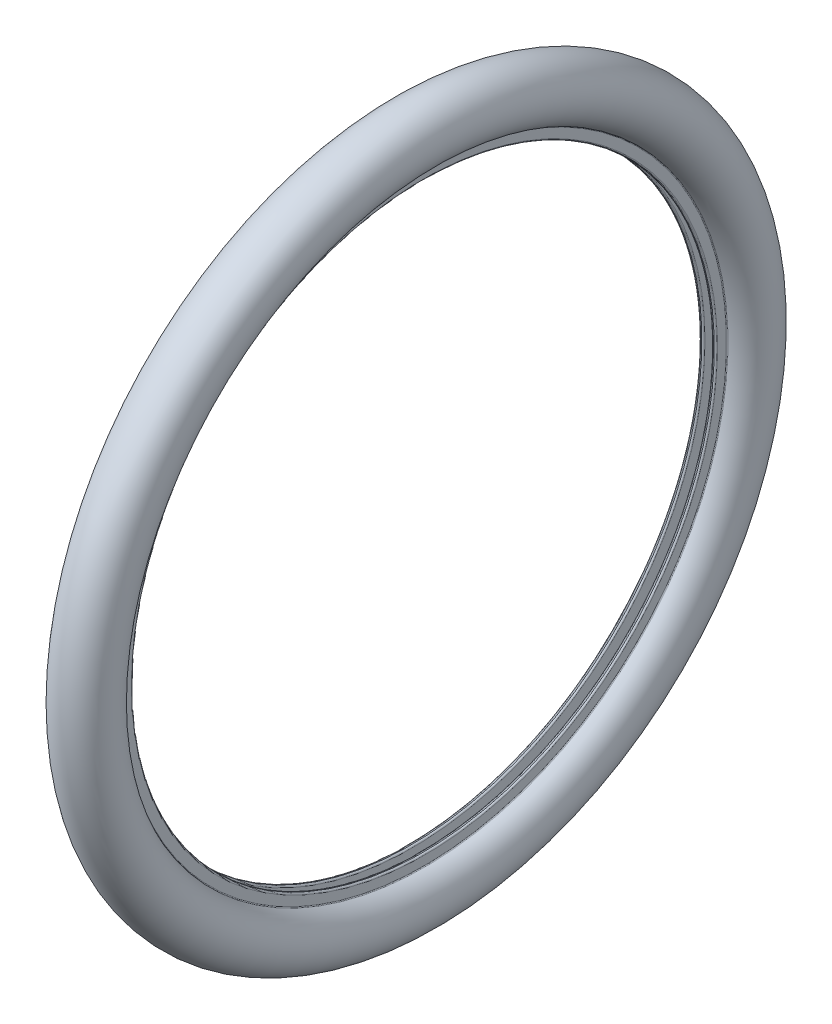
ISO-10303-21;
HEADER;
FILE_DESCRIPTION(('STEP AP214'),'2;1');
FILE_NAME('part.step','',(''),(''),'','','');
FILE_SCHEMA(('AUTOMOTIVE_DESIGN { 1 0 10303 214 1 1 1 1 }'));
ENDSEC;
DATA;
#1=APPLICATION_CONTEXT('core data for automotive mechanical design processes');
#2=APPLICATION_PROTOCOL_DEFINITION('international standard','automotive_design',2000,#1);
#3=PRODUCT_CONTEXT('',#1,'mechanical');
#4=PRODUCT('Part','Part','',(#3));
#5=PRODUCT_RELATED_PRODUCT_CATEGORY('part','',(#4));
#6=PRODUCT_DEFINITION_FORMATION('','',#4);
#7=PRODUCT_DEFINITION_CONTEXT('part definition',#1,'design');
#8=PRODUCT_DEFINITION('design','',#6,#7);
#9=PRODUCT_DEFINITION_SHAPE('','',#8);
#10=(LENGTH_UNIT() NAMED_UNIT(*) SI_UNIT(.MILLI.,.METRE.));
#11=(NAMED_UNIT(*) PLANE_ANGLE_UNIT() SI_UNIT($,.RADIAN.));
#12=(NAMED_UNIT(*) SI_UNIT($,.STERADIAN.) SOLID_ANGLE_UNIT());
#13=UNCERTAINTY_MEASURE_WITH_UNIT(LENGTH_MEASURE(1.E-05),#10,'distance_accuracy_value','');
#14=(GEOMETRIC_REPRESENTATION_CONTEXT(3) GLOBAL_UNCERTAINTY_ASSIGNED_CONTEXT((#13)) GLOBAL_UNIT_ASSIGNED_CONTEXT((#10,
#11,#12)) REPRESENTATION_CONTEXT('',''));
#15=CARTESIAN_POINT('',(0.,0.,0.));
#16=DIRECTION('',(0.,0.,1.));
#17=DIRECTION('',(1.,0.,0.));
#18=AXIS2_PLACEMENT_3D('',#15,#16,#17);
#19=CARTESIAN_POINT('',(0.,0.,0.));
#20=DIRECTION('',(-1.,0.,0.));
#21=DIRECTION('',(0.,0.,1.));
#22=AXIS2_PLACEMENT_3D('',#19,#20,#21);
#23=TOROIDAL_SURFACE('',#22,319.189528299502,19.5);
#24=CARTESIAN_POINT('',(8.,0.,0.));
#25=DIRECTION('',(-1.,0.,0.));
#26=DIRECTION('',(0.,0.,1.));
#27=AXIS2_PLACEMENT_3D('',#24,#25,#26);
#28=CIRCLE('',#27,301.406109055723);
#29=CARTESIAN_POINT('',(8.,0.,301.406109055723));
#30=VERTEX_POINT('',#29);
#31=EDGE_CURVE('E89',#30,#30,#28,.T.);
#32=ORIENTED_EDGE('',*,*,#31,.F.);
#33=EDGE_LOOP('',(#32));
#34=FACE_BOUND('',#33,.T.);
#35=CARTESIAN_POINT('',(-8.,0.,0.));
#36=DIRECTION('',(-1.,0.,0.));
#37=DIRECTION('',(0.,0.,1.));
#38=AXIS2_PLACEMENT_3D('',#35,#36,#37);
#39=CIRCLE('',#38,301.406109055723);
#40=CARTESIAN_POINT('',(-8.,0.,301.406109055723));
#41=VERTEX_POINT('',#40);
#42=EDGE_CURVE('E10',#41,#41,#39,.T.);
#43=ORIENTED_EDGE('',*,*,#42,.T.);
#44=EDGE_LOOP('',(#43));
#45=FACE_BOUND('',#44,.T.);
#46=ADVANCED_FACE('F31',(#34,#45),#23,.F.);
#47=CARTESIAN_POINT('',(-25.,0.,0.));
#48=DIRECTION('',(-1.,0.,0.));
#49=DIRECTION('',(0.,0.,1.));
#50=AXIS2_PLACEMENT_3D('',#47,#48,#49);
#51=CYLINDRICAL_SURFACE('',#50,301.406109055723);
#52=ORIENTED_EDGE('',*,*,#42,.F.);
#53=EDGE_LOOP('',(#52));
#54=FACE_BOUND('',#53,.T.);
#55=CARTESIAN_POINT('',(-7.49999999999998,0.,0.));
#56=DIRECTION('',(-1.,0.,0.));
#57=DIRECTION('',(0.,0.,1.));
#58=AXIS2_PLACEMENT_3D('',#55,#56,#57);
#59=CIRCLE('',#58,301.406109055723);
#60=CARTESIAN_POINT('',(-7.49999999999998,0.,301.406109055723));
#61=VERTEX_POINT('',#60);
#62=EDGE_CURVE('E37',#61,#61,#59,.T.);
#63=ORIENTED_EDGE('',*,*,#62,.T.);
#64=EDGE_LOOP('',(#63));
#65=FACE_BOUND('',#64,.T.);
#66=ADVANCED_FACE('F96',(#54,#65),#51,.T.);
#67=CARTESIAN_POINT('',(-7.49999999999998,0.,0.));
#68=DIRECTION('',(-1.,0.,0.));
#69=DIRECTION('',(0.,0.,1.));
#70=AXIS2_PLACEMENT_3D('',#67,#68,#69);
#71=TOROIDAL_SURFACE('',#70,297.906109055723,3.5);
#72=ORIENTED_EDGE('',*,*,#62,.F.);
#73=EDGE_LOOP('',(#72));
#74=FACE_BOUND('',#73,.T.);
#75=CARTESIAN_POINT('',(-3.99999999999998,0.,0.));
#76=DIRECTION('',(-1.,0.,0.));
#77=DIRECTION('',(0.,0.,1.));
#78=AXIS2_PLACEMENT_3D('',#75,#76,#77);
#79=CIRCLE('',#78,297.906109055723);
#80=CARTESIAN_POINT('',(-3.99999999999998,0.,297.906109055723));
#81=VERTEX_POINT('',#80);
#82=EDGE_CURVE('E41',#81,#81,#79,.T.);
#83=ORIENTED_EDGE('',*,*,#82,.T.);
#84=EDGE_LOOP('',(#83));
#85=FACE_BOUND('',#84,.T.);
#86=ADVANCED_FACE('F100',(#74,#85),#71,.T.);
#87=CARTESIAN_POINT('',(-3.99999999999998,283.5,0.));
#88=DIRECTION('',(-1.,0.,0.));
#89=DIRECTION('',(0.,0.,1.));
#90=AXIS2_PLACEMENT_3D('',#87,#88,#89);
#91=PLANE('',#90);
#92=ORIENTED_EDGE('',*,*,#82,.F.);
#93=EDGE_LOOP('',(#92));
#94=FACE_BOUND('',#93,.T.);
#95=CARTESIAN_POINT('',(-3.99999999999998,0.,0.));
#96=DIRECTION('',(-1.,0.,0.));
#97=DIRECTION('',(0.,0.,1.));
#98=AXIS2_PLACEMENT_3D('',#95,#96,#97);
#99=CIRCLE('',#98,283.5);
#100=CARTESIAN_POINT('',(-3.99999999999998,0.,283.5));
#101=VERTEX_POINT('',#100);
#102=EDGE_CURVE('E45',#101,#101,#99,.T.);
#103=ORIENTED_EDGE('',*,*,#102,.T.);
#104=EDGE_LOOP('',(#103));
#105=FACE_BOUND('',#104,.T.);
#106=ADVANCED_FACE('F105',(#94,#105),#91,.F.);
#107=CARTESIAN_POINT('',(-5.49999999999998,0.,0.));
#108=DIRECTION('',(-1.,0.,0.));
#109=DIRECTION('',(0.,0.,1.));
#110=AXIS2_PLACEMENT_3D('',#107,#108,#109);
#111=TOROIDAL_SURFACE('',#110,283.5,1.5);
#112=ORIENTED_EDGE('',*,*,#102,.F.);
#113=EDGE_LOOP('',(#112));
#114=FACE_BOUND('',#113,.T.);
#115=CARTESIAN_POINT('',(-5.49999999999998,0.,0.));
#116=DIRECTION('',(-1.,0.,0.));
#117=DIRECTION('',(0.,0.,1.));
#118=AXIS2_PLACEMENT_3D('',#115,#116,#117);
#119=CIRCLE('',#118,282.);
#120=CARTESIAN_POINT('',(-5.49999999999998,0.,282.));
#121=VERTEX_POINT('',#120);
#122=EDGE_CURVE('E50',#121,#121,#119,.T.);
#123=ORIENTED_EDGE('',*,*,#122,.T.);
#124=EDGE_LOOP('',(#123));
#125=FACE_BOUND('',#124,.T.);
#126=ADVANCED_FACE('F111',(#114,#125),#111,.T.);
#127=CARTESIAN_POINT('',(-25.,0.,0.));
#128=DIRECTION('',(-1.,0.,0.));
#129=DIRECTION('',(0.,0.,1.));
#130=AXIS2_PLACEMENT_3D('',#127,#128,#129);
#131=CYLINDRICAL_SURFACE('',#130,282.);
#132=ORIENTED_EDGE('',*,*,#122,.F.);
#133=EDGE_LOOP('',(#132));
#134=FACE_BOUND('',#133,.T.);
#135=CARTESIAN_POINT('',(-6.5,0.,0.));
#136=DIRECTION('',(-1.,0.,0.));
#137=DIRECTION('',(0.,0.,1.));
#138=AXIS2_PLACEMENT_3D('',#135,#136,#137);
#139=CIRCLE('',#138,282.);
#140=CARTESIAN_POINT('',(-6.5,0.,282.));
#141=VERTEX_POINT('',#140);
#142=EDGE_CURVE('E53',#141,#141,#139,.T.);
#143=ORIENTED_EDGE('',*,*,#142,.T.);
#144=EDGE_LOOP('',(#143));
#145=FACE_BOUND('',#144,.T.);
#146=ADVANCED_FACE('F115',(#134,#145),#131,.F.);
#147=CARTESIAN_POINT('',(-6.5,0.,0.));
#148=DIRECTION('',(-1.,0.,0.));
#149=DIRECTION('',(0.,0.,1.));
#150=AXIS2_PLACEMENT_3D('',#147,#148,#149);
#151=TOROIDAL_SURFACE('',#150,283.5,1.50000000000003);
#152=ORIENTED_EDGE('',*,*,#142,.F.);
#153=EDGE_LOOP('',(#152));
#154=FACE_BOUND('',#153,.T.);
#155=CARTESIAN_POINT('',(-8.00000000000003,0.,0.));
#156=DIRECTION('',(-1.,0.,0.));
#157=DIRECTION('',(0.,0.,1.));
#158=AXIS2_PLACEMENT_3D('',#155,#156,#157);
#159=CIRCLE('',#158,283.5);
#160=CARTESIAN_POINT('',(-8.00000000000003,0.,283.5));
#161=VERTEX_POINT('',#160);
#162=EDGE_CURVE('E56',#161,#161,#159,.T.);
#163=ORIENTED_EDGE('',*,*,#162,.T.);
#164=EDGE_LOOP('',(#163));
#165=FACE_BOUND('',#164,.T.);
#166=ADVANCED_FACE('F119',(#154,#165),#151,.T.);
#167=CARTESIAN_POINT('',(-8.00000000000001,292.218099487822,0.));
#168=DIRECTION('',(1.,0.,0.));
#169=DIRECTION('',(0.,0.,-1.));
#170=AXIS2_PLACEMENT_3D('',#167,#168,#169);
#171=PLANE('',#170);
#172=ORIENTED_EDGE('',*,*,#162,.F.);
#173=EDGE_LOOP('',(#172));
#174=FACE_BOUND('',#173,.T.);
#175=CARTESIAN_POINT('',(-8.,0.,0.));
#176=DIRECTION('',(-1.,0.,0.));
#177=DIRECTION('',(0.,0.,1.));
#178=AXIS2_PLACEMENT_3D('',#175,#176,#177);
#179=CIRCLE('',#178,292.218099487822);
#180=CARTESIAN_POINT('',(-8.,0.,292.218099487822));
#181=VERTEX_POINT('',#180);
#182=EDGE_CURVE('E59',#181,#181,#179,.T.);
#183=ORIENTED_EDGE('',*,*,#182,.T.);
#184=EDGE_LOOP('',(#183));
#185=FACE_BOUND('',#184,.T.);
#186=ADVANCED_FACE('F123',(#174,#185),#171,.F.);
#187=CARTESIAN_POINT('',(-8.90276851650059,0.,0.));
#188=DIRECTION('',(-1.,0.,0.));
#189=DIRECTION('',(0.,0.,1.));
#190=AXIS2_PLACEMENT_3D('',#187,#188,#189);
#191=TOROIDAL_SURFACE('',#190,292.218099487822,0.902768516500582);
#192=ORIENTED_EDGE('',*,*,#182,.F.);
#193=EDGE_LOOP('',(#192));
#194=FACE_BOUND('',#193,.T.);
#195=CARTESIAN_POINT('',(-8.61979824472162,0.,0.));
#196=DIRECTION('',(-1.,0.,0.));
#197=DIRECTION('',(0.,0.,1.));
#198=AXIS2_PLACEMENT_3D('',#195,#196,#197);
#199=CIRCLE('',#198,293.075373551161);
#200=CARTESIAN_POINT('',(-8.61979824472162,0.,293.075373551161));
#201=VERTEX_POINT('',#200);
#202=EDGE_CURVE('E62',#201,#201,#199,.T.);
#203=ORIENTED_EDGE('',*,*,#202,.T.);
#204=EDGE_LOOP('',(#203));
#205=FACE_BOUND('',#204,.T.);
#206=ADVANCED_FACE('F127',(#194,#205),#191,.F.);
#207=CARTESIAN_POINT('',(0.,0.,0.));
#208=DIRECTION('',(-1.,0.,0.));
#209=DIRECTION('',(0.,0.,1.));
#210=AXIS2_PLACEMENT_3D('',#207,#208,#209);
#211=TOROIDAL_SURFACE('',#210,319.189528299502,27.5);
#212=ORIENTED_EDGE('',*,*,#202,.F.);
#213=EDGE_LOOP('',(#212));
#214=FACE_BOUND('',#213,.T.);
#215=CARTESIAN_POINT('',(8.61979824472161,0.,0.));
#216=DIRECTION('',(-1.,0.,0.));
#217=DIRECTION('',(0.,0.,1.));
#218=AXIS2_PLACEMENT_3D('',#215,#216,#217);
#219=CIRCLE('',#218,293.075373551161);
#220=CARTESIAN_POINT('',(8.61979824472161,0.,293.075373551161));
#221=VERTEX_POINT('',#220);
#222=EDGE_CURVE('E65',#221,#221,#219,.T.);
#223=ORIENTED_EDGE('',*,*,#222,.T.);
#224=EDGE_LOOP('',(#223));
#225=FACE_BOUND('',#224,.T.);
#226=ADVANCED_FACE('F131',(#214,#225),#211,.T.);
#227=CARTESIAN_POINT('',(8.90276851650059,0.,0.));
#228=DIRECTION('',(-1.,0.,0.));
#229=DIRECTION('',(0.,0.,1.));
#230=AXIS2_PLACEMENT_3D('',#227,#228,#229);
#231=TOROIDAL_SURFACE('',#230,292.218099487822,0.902768516500582);
#232=ORIENTED_EDGE('',*,*,#222,.F.);
#233=EDGE_LOOP('',(#232));
#234=FACE_BOUND('',#233,.T.);
#235=CARTESIAN_POINT('',(8.00000000000001,0.,0.));
#236=DIRECTION('',(-1.,0.,0.));
#237=DIRECTION('',(0.,0.,1.));
#238=AXIS2_PLACEMENT_3D('',#235,#236,#237);
#239=CIRCLE('',#238,292.218099487822);
#240=CARTESIAN_POINT('',(8.00000000000001,0.,292.218099487822));
#241=VERTEX_POINT('',#240);
#242=EDGE_CURVE('E68',#241,#241,#239,.T.);
#243=ORIENTED_EDGE('',*,*,#242,.T.);
#244=EDGE_LOOP('',(#243));
#245=FACE_BOUND('',#244,.T.);
#246=ADVANCED_FACE('F135',(#234,#245),#231,.F.);
#247=CARTESIAN_POINT('',(8.,292.218099487822,0.));
#248=DIRECTION('',(-1.,0.,0.));
#249=DIRECTION('',(0.,0.,1.));
#250=AXIS2_PLACEMENT_3D('',#247,#248,#249);
#251=PLANE('',#250);
#252=ORIENTED_EDGE('',*,*,#242,.F.);
#253=EDGE_LOOP('',(#252));
#254=FACE_BOUND('',#253,.T.);
#255=CARTESIAN_POINT('',(8.,0.,0.));
#256=DIRECTION('',(-1.,0.,0.));
#257=DIRECTION('',(0.,0.,1.));
#258=AXIS2_PLACEMENT_3D('',#255,#256,#257);
#259=CIRCLE('',#258,283.5);
#260=CARTESIAN_POINT('',(8.,0.,283.5));
#261=VERTEX_POINT('',#260);
#262=EDGE_CURVE('E71',#261,#261,#259,.T.);
#263=ORIENTED_EDGE('',*,*,#262,.T.);
#264=EDGE_LOOP('',(#263));
#265=FACE_BOUND('',#264,.T.);
#266=ADVANCED_FACE('F139',(#254,#265),#251,.F.);
#267=CARTESIAN_POINT('',(6.5,0.,0.));
#268=DIRECTION('',(-1.,0.,0.));
#269=DIRECTION('',(0.,0.,1.));
#270=AXIS2_PLACEMENT_3D('',#267,#268,#269);
#271=TOROIDAL_SURFACE('',#270,283.5,1.5);
#272=ORIENTED_EDGE('',*,*,#262,.F.);
#273=EDGE_LOOP('',(#272));
#274=FACE_BOUND('',#273,.T.);
#275=CARTESIAN_POINT('',(6.5,0.,0.));
#276=DIRECTION('',(-1.,0.,0.));
#277=DIRECTION('',(0.,0.,1.));
#278=AXIS2_PLACEMENT_3D('',#275,#276,#277);
#279=CIRCLE('',#278,282.);
#280=CARTESIAN_POINT('',(6.5,0.,282.));
#281=VERTEX_POINT('',#280);
#282=EDGE_CURVE('E74',#281,#281,#279,.T.);
#283=ORIENTED_EDGE('',*,*,#282,.T.);
#284=EDGE_LOOP('',(#283));
#285=FACE_BOUND('',#284,.T.);
#286=ADVANCED_FACE('F143',(#274,#285),#271,.T.);
#287=CARTESIAN_POINT('',(-25.,0.,0.));
#288=DIRECTION('',(-1.,0.,0.));
#289=DIRECTION('',(0.,0.,1.));
#290=AXIS2_PLACEMENT_3D('',#287,#288,#289);
#291=CYLINDRICAL_SURFACE('',#290,282.);
#292=ORIENTED_EDGE('',*,*,#282,.F.);
#293=EDGE_LOOP('',(#292));
#294=FACE_BOUND('',#293,.T.);
#295=CARTESIAN_POINT('',(5.49999999999998,0.,0.));
#296=DIRECTION('',(-1.,0.,0.));
#297=DIRECTION('',(0.,0.,1.));
#298=AXIS2_PLACEMENT_3D('',#295,#296,#297);
#299=CIRCLE('',#298,282.);
#300=CARTESIAN_POINT('',(5.49999999999998,0.,282.));
#301=VERTEX_POINT('',#300);
#302=EDGE_CURVE('E77',#301,#301,#299,.T.);
#303=ORIENTED_EDGE('',*,*,#302,.T.);
#304=EDGE_LOOP('',(#303));
#305=FACE_BOUND('',#304,.T.);
#306=ADVANCED_FACE('F147',(#294,#305),#291,.F.);
#307=CARTESIAN_POINT('',(5.49999999999998,0.,0.));
#308=DIRECTION('',(-1.,0.,0.));
#309=DIRECTION('',(0.,0.,1.));
#310=AXIS2_PLACEMENT_3D('',#307,#308,#309);
#311=TOROIDAL_SURFACE('',#310,283.5,1.5);
#312=ORIENTED_EDGE('',*,*,#302,.F.);
#313=EDGE_LOOP('',(#312));
#314=FACE_BOUND('',#313,.T.);
#315=CARTESIAN_POINT('',(3.99999999999998,0.,0.));
#316=DIRECTION('',(-1.,0.,0.));
#317=DIRECTION('',(0.,0.,1.));
#318=AXIS2_PLACEMENT_3D('',#315,#316,#317);
#319=CIRCLE('',#318,283.5);
#320=CARTESIAN_POINT('',(3.99999999999998,0.,283.5));
#321=VERTEX_POINT('',#320);
#322=EDGE_CURVE('E80',#321,#321,#319,.T.);
#323=ORIENTED_EDGE('',*,*,#322,.T.);
#324=EDGE_LOOP('',(#323));
#325=FACE_BOUND('',#324,.T.);
#326=ADVANCED_FACE('F151',(#314,#325),#311,.T.);
#327=CARTESIAN_POINT('',(3.99999999999998,283.5,0.));
#328=DIRECTION('',(1.,0.,0.));
#329=DIRECTION('',(0.,0.,-1.));
#330=AXIS2_PLACEMENT_3D('',#327,#328,#329);
#331=PLANE('',#330);
#332=ORIENTED_EDGE('',*,*,#322,.F.);
#333=EDGE_LOOP('',(#332));
#334=FACE_BOUND('',#333,.T.);
#335=CARTESIAN_POINT('',(3.99999999999998,0.,0.));
#336=DIRECTION('',(-1.,0.,0.));
#337=DIRECTION('',(0.,0.,1.));
#338=AXIS2_PLACEMENT_3D('',#335,#336,#337);
#339=CIRCLE('',#338,297.906109055723);
#340=CARTESIAN_POINT('',(3.99999999999998,0.,297.906109055723));
#341=VERTEX_POINT('',#340);
#342=EDGE_CURVE('E83',#341,#341,#339,.T.);
#343=ORIENTED_EDGE('',*,*,#342,.T.);
#344=EDGE_LOOP('',(#343));
#345=FACE_BOUND('',#344,.T.);
#346=ADVANCED_FACE('F155',(#334,#345),#331,.F.);
#347=CARTESIAN_POINT('',(7.49999999999998,0.,0.));
#348=DIRECTION('',(-1.,0.,0.));
#349=DIRECTION('',(0.,0.,1.));
#350=AXIS2_PLACEMENT_3D('',#347,#348,#349);
#351=TOROIDAL_SURFACE('',#350,297.906109055723,3.5);
#352=ORIENTED_EDGE('',*,*,#342,.F.);
#353=EDGE_LOOP('',(#352));
#354=FACE_BOUND('',#353,.T.);
#355=CARTESIAN_POINT('',(7.49999999999998,0.,0.));
#356=DIRECTION('',(-1.,0.,0.));
#357=DIRECTION('',(0.,0.,1.));
#358=AXIS2_PLACEMENT_3D('',#355,#356,#357);
#359=CIRCLE('',#358,301.406109055723);
#360=CARTESIAN_POINT('',(7.49999999999998,0.,301.406109055723));
#361=VERTEX_POINT('',#360);
#362=EDGE_CURVE('E86',#361,#361,#359,.T.);
#363=ORIENTED_EDGE('',*,*,#362,.T.);
#364=EDGE_LOOP('',(#363));
#365=FACE_BOUND('',#364,.T.);
#366=ADVANCED_FACE('F159',(#354,#365),#351,.T.);
#367=CARTESIAN_POINT('',(-25.,0.,0.));
#368=DIRECTION('',(-1.,0.,0.));
#369=DIRECTION('',(0.,0.,1.));
#370=AXIS2_PLACEMENT_3D('',#367,#368,#369);
#371=CYLINDRICAL_SURFACE('',#370,301.406109055723);
#372=ORIENTED_EDGE('',*,*,#362,.F.);
#373=EDGE_LOOP('',(#372));
#374=FACE_BOUND('',#373,.T.);
#375=ORIENTED_EDGE('',*,*,#31,.T.);
#376=EDGE_LOOP('',(#375));
#377=FACE_BOUND('',#376,.T.);
#378=ADVANCED_FACE('F93',(#374,#377),#371,.T.);
#379=CLOSED_SHELL('',(#46,#66,#86,#106,#126,#146,#166,#186,#206,#226,#246,#266,#286,#306,#326,
#346,#366,#378));
#380=MANIFOLD_SOLID_BREP('B2',#379);
#381=ADVANCED_BREP_SHAPE_REPRESENTATION('',(#18,#380),#14);
#382=SHAPE_DEFINITION_REPRESENTATION(#9,#381);
ENDSEC;
END-ISO-10303-21;
